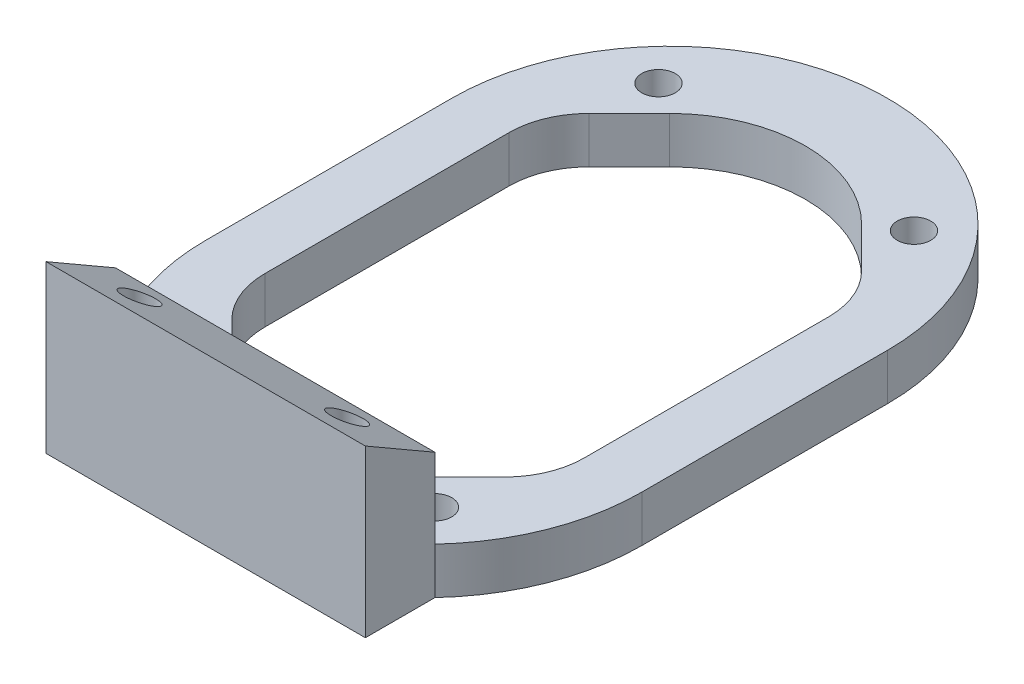
ISO-10303-21;
HEADER;
FILE_DESCRIPTION(('STEP AP214'),'2;1');
FILE_NAME('part.step','',(''),(''),'','','');
FILE_SCHEMA(('AUTOMOTIVE_DESIGN { 1 0 10303 214 1 1 1 1 }'));
ENDSEC;
DATA;
#1=APPLICATION_CONTEXT('core data for automotive mechanical design processes');
#2=APPLICATION_PROTOCOL_DEFINITION('international standard','automotive_design',2000,#1);
#3=PRODUCT_CONTEXT('',#1,'mechanical');
#4=PRODUCT('Part','Part','',(#3));
#5=PRODUCT_RELATED_PRODUCT_CATEGORY('part','',(#4));
#6=PRODUCT_DEFINITION_FORMATION('','',#4);
#7=PRODUCT_DEFINITION_CONTEXT('part definition',#1,'design');
#8=PRODUCT_DEFINITION('design','',#6,#7);
#9=PRODUCT_DEFINITION_SHAPE('','',#8);
#10=(LENGTH_UNIT() NAMED_UNIT(*) SI_UNIT(.MILLI.,.METRE.));
#11=(NAMED_UNIT(*) PLANE_ANGLE_UNIT() SI_UNIT($,.RADIAN.));
#12=(NAMED_UNIT(*) SI_UNIT($,.STERADIAN.) SOLID_ANGLE_UNIT());
#13=UNCERTAINTY_MEASURE_WITH_UNIT(LENGTH_MEASURE(1.E-05),#10,'distance_accuracy_value','');
#14=(GEOMETRIC_REPRESENTATION_CONTEXT(3) GLOBAL_UNCERTAINTY_ASSIGNED_CONTEXT((#13)) GLOBAL_UNIT_ASSIGNED_CONTEXT((#10,
#11,#12)) REPRESENTATION_CONTEXT('',''));
#15=CARTESIAN_POINT('',(0.,0.,0.));
#16=DIRECTION('',(0.,0.,1.));
#17=DIRECTION('',(1.,0.,0.));
#18=AXIS2_PLACEMENT_3D('',#15,#16,#17);
#19=CARTESIAN_POINT('',(0.,2.9,-7.69999999999999));
#20=DIRECTION('',(0.,-1.,0.));
#21=DIRECTION('',(0.,0.,-1.));
#22=AXIS2_PLACEMENT_3D('',#19,#20,#21);
#23=PLANE('',#22);
#24=CARTESIAN_POINT('',(0.,2.9,7.69999999999999));
#25=DIRECTION('',(0.,1.,0.));
#26=DIRECTION('',(0.,0.,1.));
#27=AXIS2_PLACEMENT_3D('',#24,#25,#26);
#28=CIRCLE('',#27,13.6561341528267);
#29=CARTESIAN_POINT('',(-13.6561341528267,2.9,7.69999999999999));
#30=VERTEX_POINT('',#29);
#31=CARTESIAN_POINT('',(-10.,2.9,17.));
#32=VERTEX_POINT('',#31);
#33=EDGE_CURVE('E216',#30,#32,#28,.T.);
#34=ORIENTED_EDGE('',*,*,#33,.T.);
#35=DIRECTION('',(1.,0.,0.));
#36=VECTOR('',#35,1.);
#37=CARTESIAN_POINT('',(0.,2.9,17.));
#38=LINE('',#37,#36);
#39=CARTESIAN_POINT('',(10.,2.9,17.));
#40=VERTEX_POINT('',#39);
#41=EDGE_CURVE('E401',#32,#40,#38,.T.);
#42=ORIENTED_EDGE('',*,*,#41,.T.);
#43=CARTESIAN_POINT('',(13.6561341528267,2.9,7.69999999999999));
#44=VERTEX_POINT('',#43);
#45=EDGE_CURVE('E215',#40,#44,#28,.T.);
#46=ORIENTED_EDGE('',*,*,#45,.T.);
#47=DIRECTION('',(0.,0.,-1.));
#48=VECTOR('',#47,1.);
#49=CARTESIAN_POINT('',(13.6561341528267,2.9,-7.69999999999999));
#50=LINE('',#49,#48);
#51=CARTESIAN_POINT('',(13.6561341528267,2.9,-7.69999999999999));
#52=VERTEX_POINT('',#51);
#53=EDGE_CURVE('E219',#44,#52,#50,.T.);
#54=ORIENTED_EDGE('',*,*,#53,.T.);
#55=CARTESIAN_POINT('',(0.,2.9,-7.69999999999999));
#56=DIRECTION('',(0.,1.,0.));
#57=DIRECTION('',(0.,0.,-1.));
#58=AXIS2_PLACEMENT_3D('',#55,#56,#57);
#59=CIRCLE('',#58,13.6561341528267);
#60=CARTESIAN_POINT('',(-13.6561341528267,2.9,-7.69999999999999));
#61=VERTEX_POINT('',#60);
#62=EDGE_CURVE('E209',#52,#61,#59,.T.);
#63=ORIENTED_EDGE('',*,*,#62,.T.);
#64=DIRECTION('',(0.,0.,1.));
#65=VECTOR('',#64,1.);
#66=CARTESIAN_POINT('',(-13.6561341528267,2.9,7.69999999999999));
#67=LINE('',#66,#65);
#68=EDGE_CURVE('E212',#61,#30,#67,.T.);
#69=ORIENTED_EDGE('',*,*,#68,.T.);
#70=EDGE_LOOP('',(#34,#42,#46,#54,#63,#69));
#71=FACE_BOUND('',#70,.T.);
#72=CARTESIAN_POINT('',(-8.,2.9,-15.));
#73=DIRECTION('',(0.,1.,0.));
#74=DIRECTION('',(0.,0.,1.));
#75=AXIS2_PLACEMENT_3D('',#72,#73,#74);
#76=CIRCLE('',#75,1.05);
#77=CARTESIAN_POINT('',(-8.,2.9,-13.95));
#78=VERTEX_POINT('',#77);
#79=EDGE_CURVE('E203',#78,#78,#76,.T.);
#80=ORIENTED_EDGE('',*,*,#79,.F.);
#81=EDGE_LOOP('',(#80));
#82=FACE_BOUND('',#81,.T.);
#83=CARTESIAN_POINT('',(8.,2.9,-15.));
#84=DIRECTION('',(0.,1.,0.));
#85=DIRECTION('',(0.,0.,1.));
#86=AXIS2_PLACEMENT_3D('',#83,#84,#85);
#87=CIRCLE('',#86,1.05);
#88=CARTESIAN_POINT('',(8.,2.9,-13.95));
#89=VERTEX_POINT('',#88);
#90=EDGE_CURVE('E408',#89,#89,#87,.T.);
#91=ORIENTED_EDGE('',*,*,#90,.F.);
#92=EDGE_LOOP('',(#91));
#93=FACE_BOUND('',#92,.T.);
#94=CARTESIAN_POINT('',(8.,2.9,15.));
#95=DIRECTION('',(0.,1.,0.));
#96=DIRECTION('',(0.,0.,1.));
#97=AXIS2_PLACEMENT_3D('',#94,#95,#96);
#98=CIRCLE('',#97,1.05);
#99=CARTESIAN_POINT('',(8.,2.9,16.05));
#100=VERTEX_POINT('',#99);
#101=EDGE_CURVE('E414',#100,#100,#98,.T.);
#102=ORIENTED_EDGE('',*,*,#101,.F.);
#103=EDGE_LOOP('',(#102));
#104=FACE_BOUND('',#103,.T.);
#105=CARTESIAN_POINT('',(-8.,2.9,15.));
#106=DIRECTION('',(0.,1.,0.));
#107=DIRECTION('',(0.,0.,1.));
#108=AXIS2_PLACEMENT_3D('',#105,#106,#107);
#109=CIRCLE('',#108,1.05);
#110=CARTESIAN_POINT('',(-8.,2.9,16.05));
#111=VERTEX_POINT('',#110);
#112=EDGE_CURVE('E404',#111,#111,#109,.T.);
#113=ORIENTED_EDGE('',*,*,#112,.F.);
#114=EDGE_LOOP('',(#113));
#115=FACE_BOUND('',#114,.T.);
#116=DIRECTION('',(0.707106781186544,0.,0.707106781186551));
#117=VECTOR('',#116,1.);
#118=CARTESIAN_POINT('',(6.01040764008568,2.9,-13.7104076400856));
#119=LINE('',#118,#117);
#120=CARTESIAN_POINT('',(6.01040764008568,2.9,-13.7104076400856));
#121=VERTEX_POINT('',#120);
#122=CARTESIAN_POINT('',(8.53553390593275,2.9,-11.1852813742385));
#123=VERTEX_POINT('',#122);
#124=EDGE_CURVE('E178',#121,#123,#119,.T.);
#125=ORIENTED_EDGE('',*,*,#124,.T.);
#126=CARTESIAN_POINT('',(5.,2.9,-7.6497474683058));
#127=DIRECTION('',(0.,-1.,0.));
#128=DIRECTION('',(0.,0.,-1.));
#129=AXIS2_PLACEMENT_3D('',#126,#127,#128);
#130=CIRCLE('',#129,5.);
#131=CARTESIAN_POINT('',(10.,2.9,-7.64974746830579));
#132=VERTEX_POINT('',#131);
#133=EDGE_CURVE('E40',#123,#132,#130,.T.);
#134=ORIENTED_EDGE('',*,*,#133,.T.);
#135=DIRECTION('',(0.,0.,1.));
#136=VECTOR('',#135,1.);
#137=CARTESIAN_POINT('',(10.,2.9,-9.72081528017126));
#138=LINE('',#137,#136);
#139=CARTESIAN_POINT('',(9.99999999999999,2.9,7.6497474683058));
#140=VERTEX_POINT('',#139);
#141=EDGE_CURVE('E190',#132,#140,#138,.T.);
#142=ORIENTED_EDGE('',*,*,#141,.T.);
#143=CARTESIAN_POINT('',(4.99999999999999,2.9,7.6497474683058));
#144=DIRECTION('',(0.,-1.,0.));
#145=DIRECTION('',(0.,0.,-1.));
#146=AXIS2_PLACEMENT_3D('',#143,#144,#145);
#147=CIRCLE('',#146,5.);
#148=CARTESIAN_POINT('',(8.53553390593275,2.9,11.1852813742385));
#149=VERTEX_POINT('',#148);
#150=EDGE_CURVE('E280',#140,#149,#147,.T.);
#151=ORIENTED_EDGE('',*,*,#150,.T.);
#152=DIRECTION('',(-0.707106781186544,0.,0.707106781186551));
#153=VECTOR('',#152,1.);
#154=CARTESIAN_POINT('',(9.99999999999999,2.9,9.72081528017126));
#155=LINE('',#154,#153);
#156=CARTESIAN_POINT('',(6.01040764008568,2.9,13.7104076400856));
#157=VERTEX_POINT('',#156);
#158=EDGE_CURVE('E290',#149,#157,#155,.T.);
#159=ORIENTED_EDGE('',*,*,#158,.T.);
#160=CARTESIAN_POINT('',(0.,2.9,7.69999999999999));
#161=DIRECTION('',(0.,1.,0.));
#162=DIRECTION('',(0.,0.,1.));
#163=AXIS2_PLACEMENT_3D('',#160,#161,#162);
#164=CIRCLE('',#163,8.5);
#165=CARTESIAN_POINT('',(-6.01040764008568,2.9,13.7104076400856));
#166=VERTEX_POINT('',#165);
#167=EDGE_CURVE('E206',#166,#157,#164,.T.);
#168=ORIENTED_EDGE('',*,*,#167,.F.);
#169=DIRECTION('',(0.707106781186544,0.,0.707106781186551));
#170=VECTOR('',#169,1.);
#171=CARTESIAN_POINT('',(-9.99999999999999,2.9,9.72081528017126));
#172=LINE('',#171,#170);
#173=CARTESIAN_POINT('',(-8.53553390593275,2.9,11.1852813742385));
#174=VERTEX_POINT('',#173);
#175=EDGE_CURVE('E357',#174,#166,#172,.T.);
#176=ORIENTED_EDGE('',*,*,#175,.F.);
#177=CARTESIAN_POINT('',(-4.99999999999999,2.9,7.6497474683058));
#178=DIRECTION('',(0.,-1.,0.));
#179=DIRECTION('',(0.,0.,-1.));
#180=AXIS2_PLACEMENT_3D('',#177,#178,#179);
#181=CIRCLE('',#180,5.);
#182=CARTESIAN_POINT('',(-9.99999999999999,2.9,7.6497474683058));
#183=VERTEX_POINT('',#182);
#184=EDGE_CURVE('E263',#174,#183,#181,.T.);
#185=ORIENTED_EDGE('',*,*,#184,.T.);
#186=DIRECTION('',(0.,0.,1.));
#187=VECTOR('',#186,1.);
#188=CARTESIAN_POINT('',(-10.,2.9,-9.72081528017126));
#189=LINE('',#188,#187);
#190=CARTESIAN_POINT('',(-10.,2.9,-7.64974746830579));
#191=VERTEX_POINT('',#190);
#192=EDGE_CURVE('E363',#191,#183,#189,.T.);
#193=ORIENTED_EDGE('',*,*,#192,.F.);
#194=CARTESIAN_POINT('',(-5.,2.9,-7.6497474683058));
#195=DIRECTION('',(0.,-1.,0.));
#196=DIRECTION('',(0.,0.,-1.));
#197=AXIS2_PLACEMENT_3D('',#194,#195,#196);
#198=CIRCLE('',#197,5.);
#199=CARTESIAN_POINT('',(-8.53553390593275,2.9,-11.1852813742385));
#200=VERTEX_POINT('',#199);
#201=EDGE_CURVE('E267',#191,#200,#198,.T.);
#202=ORIENTED_EDGE('',*,*,#201,.T.);
#203=DIRECTION('',(-0.707106781186544,0.,0.707106781186551));
#204=VECTOR('',#203,1.);
#205=CARTESIAN_POINT('',(-6.01040764008568,2.9,-13.7104076400856));
#206=LINE('',#205,#204);
#207=CARTESIAN_POINT('',(-6.01040764008568,2.9,-13.7104076400856));
#208=VERTEX_POINT('',#207);
#209=EDGE_CURVE('E360',#208,#200,#206,.T.);
#210=ORIENTED_EDGE('',*,*,#209,.F.);
#211=CARTESIAN_POINT('',(0.,2.9,-7.69999999999999));
#212=DIRECTION('',(0.,1.,0.));
#213=DIRECTION('',(0.,0.,-1.));
#214=AXIS2_PLACEMENT_3D('',#211,#212,#213);
#215=CIRCLE('',#214,8.5);
#216=EDGE_CURVE('E200',#121,#208,#215,.T.);
#217=ORIENTED_EDGE('',*,*,#216,.F.);
#218=EDGE_LOOP('',(#125,#134,#142,#151,#159,#168,#176,#185,#193,#202,#210,#217));
#219=FACE_BOUND('',#218,.T.);
#220=ADVANCED_FACE('F32',(#71,#82,#93,#104,#115,#219),#23,.F.);
#221=CARTESIAN_POINT('',(0.,0.,-7.69999999999999));
#222=DIRECTION('',(0.,-1.,0.));
#223=DIRECTION('',(0.,0.,-1.));
#224=AXIS2_PLACEMENT_3D('',#221,#222,#223);
#225=PLANE('',#224);
#226=CARTESIAN_POINT('',(6.5,0.,18.9999999999999));
#227=DIRECTION('',(0.,-1.,0.));
#228=DIRECTION('',(0.,0.,-1.));
#229=AXIS2_PLACEMENT_3D('',#226,#227,#228);
#230=CIRCLE('',#229,1.);
#231=CARTESIAN_POINT('',(6.5,0.,17.9999999999999));
#232=VERTEX_POINT('',#231);
#233=EDGE_CURVE('E250',#232,#232,#230,.T.);
#234=ORIENTED_EDGE('',*,*,#233,.F.);
#235=EDGE_LOOP('',(#234));
#236=FACE_BOUND('',#235,.T.);
#237=CARTESIAN_POINT('',(-6.5,0.,18.9999999999999));
#238=DIRECTION('',(0.,-1.,0.));
#239=DIRECTION('',(0.,0.,-1.));
#240=AXIS2_PLACEMENT_3D('',#237,#238,#239);
#241=CIRCLE('',#240,1.);
#242=CARTESIAN_POINT('',(-6.5,0.,17.9999999999999));
#243=VERTEX_POINT('',#242);
#244=EDGE_CURVE('E367',#243,#243,#241,.T.);
#245=ORIENTED_EDGE('',*,*,#244,.F.);
#246=EDGE_LOOP('',(#245));
#247=FACE_BOUND('',#246,.T.);
#248=CARTESIAN_POINT('',(0.,0.,7.69999999999999));
#249=DIRECTION('',(0.,1.,0.));
#250=DIRECTION('',(0.,0.,1.));
#251=AXIS2_PLACEMENT_3D('',#248,#249,#250);
#252=CIRCLE('',#251,13.6561341528267);
#253=CARTESIAN_POINT('',(10.,0.,17.));
#254=VERTEX_POINT('',#253);
#255=CARTESIAN_POINT('',(13.6561341528267,0.,7.69999999999999));
#256=VERTEX_POINT('',#255);
#257=EDGE_CURVE('E227',#254,#256,#252,.T.);
#258=ORIENTED_EDGE('',*,*,#257,.F.);
#259=DIRECTION('',(0.,0.,-1.));
#260=VECTOR('',#259,1.);
#261=CARTESIAN_POINT('',(10.,0.,17.));
#262=LINE('',#261,#260);
#263=CARTESIAN_POINT('',(10.,0.,21.3561341528267));
#264=VERTEX_POINT('',#263);
#265=EDGE_CURVE('E388',#264,#254,#262,.T.);
#266=ORIENTED_EDGE('',*,*,#265,.F.);
#267=DIRECTION('',(1.,0.,0.));
#268=VECTOR('',#267,1.);
#269=CARTESIAN_POINT('',(10.,0.,21.3561341528267));
#270=LINE('',#269,#268);
#271=CARTESIAN_POINT('',(-9.99999999999999,0.,21.3561341528267));
#272=VERTEX_POINT('',#271);
#273=EDGE_CURVE('E379',#272,#264,#270,.T.);
#274=ORIENTED_EDGE('',*,*,#273,.F.);
#275=DIRECTION('',(0.,0.,1.));
#276=VECTOR('',#275,1.);
#277=CARTESIAN_POINT('',(-10.,0.,17.));
#278=LINE('',#277,#276);
#279=CARTESIAN_POINT('',(-10.,0.,17.));
#280=VERTEX_POINT('',#279);
#281=EDGE_CURVE('E383',#280,#272,#278,.T.);
#282=ORIENTED_EDGE('',*,*,#281,.F.);
#283=CARTESIAN_POINT('',(-13.6561341528267,0.,7.69999999999999));
#284=VERTEX_POINT('',#283);
#285=EDGE_CURVE('E228',#284,#280,#252,.T.);
#286=ORIENTED_EDGE('',*,*,#285,.F.);
#287=DIRECTION('',(0.,0.,1.));
#288=VECTOR('',#287,1.);
#289=CARTESIAN_POINT('',(-13.6561341528267,0.,7.69999999999999));
#290=LINE('',#289,#288);
#291=CARTESIAN_POINT('',(-13.6561341528267,0.,-7.69999999999999));
#292=VERTEX_POINT('',#291);
#293=EDGE_CURVE('E225',#292,#284,#290,.T.);
#294=ORIENTED_EDGE('',*,*,#293,.F.);
#295=CARTESIAN_POINT('',(0.,0.,-7.69999999999999));
#296=DIRECTION('',(0.,1.,0.));
#297=DIRECTION('',(0.,0.,-1.));
#298=AXIS2_PLACEMENT_3D('',#295,#296,#297);
#299=CIRCLE('',#298,13.6561341528267);
#300=CARTESIAN_POINT('',(13.6561341528267,0.,-7.69999999999999));
#301=VERTEX_POINT('',#300);
#302=EDGE_CURVE('E222',#301,#292,#299,.T.);
#303=ORIENTED_EDGE('',*,*,#302,.F.);
#304=DIRECTION('',(0.,0.,-1.));
#305=VECTOR('',#304,1.);
#306=CARTESIAN_POINT('',(13.6561341528267,0.,-7.69999999999999));
#307=LINE('',#306,#305);
#308=EDGE_CURVE('E213',#256,#301,#307,.T.);
#309=ORIENTED_EDGE('',*,*,#308,.F.);
#310=EDGE_LOOP('',(#258,#266,#274,#282,#286,#294,#303,#309));
#311=FACE_BOUND('',#310,.T.);
#312=CARTESIAN_POINT('',(-8.,0.,15.));
#313=DIRECTION('',(0.,1.,0.));
#314=DIRECTION('',(0.,0.,1.));
#315=AXIS2_PLACEMENT_3D('',#312,#313,#314);
#316=CIRCLE('',#315,1.05);
#317=CARTESIAN_POINT('',(-8.,0.,16.05));
#318=VERTEX_POINT('',#317);
#319=EDGE_CURVE('E417',#318,#318,#316,.T.);
#320=ORIENTED_EDGE('',*,*,#319,.T.);
#321=EDGE_LOOP('',(#320));
#322=FACE_BOUND('',#321,.T.);
#323=CARTESIAN_POINT('',(8.,0.,15.));
#324=DIRECTION('',(0.,1.,0.));
#325=DIRECTION('',(0.,0.,1.));
#326=AXIS2_PLACEMENT_3D('',#323,#324,#325);
#327=CIRCLE('',#326,1.05);
#328=CARTESIAN_POINT('',(8.,0.,16.05));
#329=VERTEX_POINT('',#328);
#330=EDGE_CURVE('E411',#329,#329,#327,.T.);
#331=ORIENTED_EDGE('',*,*,#330,.T.);
#332=EDGE_LOOP('',(#331));
#333=FACE_BOUND('',#332,.T.);
#334=CARTESIAN_POINT('',(8.,0.,-15.));
#335=DIRECTION('',(0.,1.,0.));
#336=DIRECTION('',(0.,0.,1.));
#337=AXIS2_PLACEMENT_3D('',#334,#335,#336);
#338=CIRCLE('',#337,1.05);
#339=CARTESIAN_POINT('',(8.,0.,-13.95));
#340=VERTEX_POINT('',#339);
#341=EDGE_CURVE('E405',#340,#340,#338,.T.);
#342=ORIENTED_EDGE('',*,*,#341,.T.);
#343=EDGE_LOOP('',(#342));
#344=FACE_BOUND('',#343,.T.);
#345=CARTESIAN_POINT('',(-8.,0.,-15.));
#346=DIRECTION('',(0.,1.,0.));
#347=DIRECTION('',(0.,0.,1.));
#348=AXIS2_PLACEMENT_3D('',#345,#346,#347);
#349=CIRCLE('',#348,1.05);
#350=CARTESIAN_POINT('',(-8.,0.,-13.95));
#351=VERTEX_POINT('',#350);
#352=EDGE_CURVE('E197',#351,#351,#349,.T.);
#353=ORIENTED_EDGE('',*,*,#352,.T.);
#354=EDGE_LOOP('',(#353));
#355=FACE_BOUND('',#354,.T.);
#356=DIRECTION('',(0.,0.,1.));
#357=VECTOR('',#356,1.);
#358=CARTESIAN_POINT('',(10.,0.,-9.72081528017126));
#359=LINE('',#358,#357);
#360=CARTESIAN_POINT('',(10.,0.,-7.64974746830579));
#361=VERTEX_POINT('',#360);
#362=CARTESIAN_POINT('',(9.99999999999999,0.,7.6497474683058));
#363=VERTEX_POINT('',#362);
#364=EDGE_CURVE('E183',#361,#363,#359,.T.);
#365=ORIENTED_EDGE('',*,*,#364,.F.);
#366=CARTESIAN_POINT('',(5.,0.,-7.6497474683058));
#367=DIRECTION('',(0.,-1.,0.));
#368=DIRECTION('',(0.,0.,-1.));
#369=AXIS2_PLACEMENT_3D('',#366,#367,#368);
#370=CIRCLE('',#369,5.);
#371=CARTESIAN_POINT('',(8.53553390593275,0.,-11.1852813742385));
#372=VERTEX_POINT('',#371);
#373=EDGE_CURVE('E11',#361,#372,#370,.F.);
#374=ORIENTED_EDGE('',*,*,#373,.T.);
#375=DIRECTION('',(0.707106781186544,0.,0.707106781186551));
#376=VECTOR('',#375,1.);
#377=CARTESIAN_POINT('',(6.01040764008568,0.,-13.7104076400856));
#378=LINE('',#377,#376);
#379=CARTESIAN_POINT('',(6.01040764008568,0.,-13.7104076400856));
#380=VERTEX_POINT('',#379);
#381=EDGE_CURVE('E176',#380,#372,#378,.T.);
#382=ORIENTED_EDGE('',*,*,#381,.F.);
#383=CARTESIAN_POINT('',(0.,0.,-7.69999999999999));
#384=DIRECTION('',(0.,1.,0.));
#385=DIRECTION('',(0.,0.,-1.));
#386=AXIS2_PLACEMENT_3D('',#383,#384,#385);
#387=CIRCLE('',#386,8.5);
#388=CARTESIAN_POINT('',(-6.01040764008568,0.,-13.7104076400856));
#389=VERTEX_POINT('',#388);
#390=EDGE_CURVE('E187',#380,#389,#387,.T.);
#391=ORIENTED_EDGE('',*,*,#390,.T.);
#392=DIRECTION('',(-0.707106781186544,0.,0.707106781186551));
#393=VECTOR('',#392,1.);
#394=CARTESIAN_POINT('',(-6.01040764008568,0.,-13.7104076400856));
#395=LINE('',#394,#393);
#396=CARTESIAN_POINT('',(-8.53553390593275,0.,-11.1852813742385));
#397=VERTEX_POINT('',#396);
#398=EDGE_CURVE('E348',#389,#397,#395,.T.);
#399=ORIENTED_EDGE('',*,*,#398,.T.);
#400=CARTESIAN_POINT('',(-5.,0.,-7.6497474683058));
#401=DIRECTION('',(0.,-1.,0.));
#402=DIRECTION('',(0.,0.,-1.));
#403=AXIS2_PLACEMENT_3D('',#400,#401,#402);
#404=CIRCLE('',#403,5.);
#405=CARTESIAN_POINT('',(-10.,0.,-7.64974746830579));
#406=VERTEX_POINT('',#405);
#407=EDGE_CURVE('E269',#397,#406,#404,.F.);
#408=ORIENTED_EDGE('',*,*,#407,.T.);
#409=DIRECTION('',(0.,0.,1.));
#410=VECTOR('',#409,1.);
#411=CARTESIAN_POINT('',(-10.,0.,-9.72081528017126));
#412=LINE('',#411,#410);
#413=CARTESIAN_POINT('',(-9.99999999999999,0.,7.6497474683058));
#414=VERTEX_POINT('',#413);
#415=EDGE_CURVE('E346',#406,#414,#412,.T.);
#416=ORIENTED_EDGE('',*,*,#415,.T.);
#417=CARTESIAN_POINT('',(-4.99999999999999,0.,7.6497474683058));
#418=DIRECTION('',(0.,-1.,0.));
#419=DIRECTION('',(0.,0.,-1.));
#420=AXIS2_PLACEMENT_3D('',#417,#418,#419);
#421=CIRCLE('',#420,5.);
#422=CARTESIAN_POINT('',(-8.53553390593275,0.,11.1852813742385));
#423=VERTEX_POINT('',#422);
#424=EDGE_CURVE('E265',#414,#423,#421,.F.);
#425=ORIENTED_EDGE('',*,*,#424,.T.);
#426=DIRECTION('',(0.707106781186544,0.,0.707106781186551));
#427=VECTOR('',#426,1.);
#428=CARTESIAN_POINT('',(-9.99999999999999,0.,9.72081528017126));
#429=LINE('',#428,#427);
#430=CARTESIAN_POINT('',(-6.01040764008568,0.,13.7104076400856));
#431=VERTEX_POINT('',#430);
#432=EDGE_CURVE('E353',#423,#431,#429,.T.);
#433=ORIENTED_EDGE('',*,*,#432,.T.);
#434=CARTESIAN_POINT('',(0.,0.,7.69999999999999));
#435=DIRECTION('',(0.,1.,0.));
#436=DIRECTION('',(0.,0.,1.));
#437=AXIS2_PLACEMENT_3D('',#434,#435,#436);
#438=CIRCLE('',#437,8.5);
#439=CARTESIAN_POINT('',(6.01040764008568,0.,13.7104076400856));
#440=VERTEX_POINT('',#439);
#441=EDGE_CURVE('E196',#431,#440,#438,.T.);
#442=ORIENTED_EDGE('',*,*,#441,.T.);
#443=DIRECTION('',(-0.707106781186544,0.,0.707106781186551));
#444=VECTOR('',#443,1.);
#445=CARTESIAN_POINT('',(9.99999999999999,0.,9.72081528017126));
#446=LINE('',#445,#444);
#447=CARTESIAN_POINT('',(8.53553390593275,0.,11.1852813742385));
#448=VERTEX_POINT('',#447);
#449=EDGE_CURVE('E189',#448,#440,#446,.T.);
#450=ORIENTED_EDGE('',*,*,#449,.F.);
#451=CARTESIAN_POINT('',(4.99999999999999,0.,7.6497474683058));
#452=DIRECTION('',(0.,-1.,0.));
#453=DIRECTION('',(0.,0.,-1.));
#454=AXIS2_PLACEMENT_3D('',#451,#452,#453);
#455=CIRCLE('',#454,5.);
#456=EDGE_CURVE('E282',#448,#363,#455,.F.);
#457=ORIENTED_EDGE('',*,*,#456,.T.);
#458=EDGE_LOOP('',(#365,#374,#382,#391,#399,#408,#416,#425,#433,#442,#450,#457));
#459=FACE_BOUND('',#458,.T.);
#460=ADVANCED_FACE('F185',(#236,#247,#311,#322,#333,#344,#355,#459),#225,.T.);
#461=CARTESIAN_POINT('',(0.,2.9,-7.69999999999999));
#462=DIRECTION('',(0.,-1.,0.));
#463=DIRECTION('',(0.,0.,-1.));
#464=AXIS2_PLACEMENT_3D('',#461,#462,#463);
#465=CYLINDRICAL_SURFACE('',#464,8.5);
#466=ORIENTED_EDGE('',*,*,#390,.F.);
#467=DIRECTION('',(0.,1.,0.));
#468=VECTOR('',#467,1.);
#469=CARTESIAN_POINT('',(6.01040764008568,0.,-13.7104076400856));
#470=LINE('',#469,#468);
#471=EDGE_CURVE('E174',#380,#121,#470,.T.);
#472=ORIENTED_EDGE('',*,*,#471,.T.);
#473=ORIENTED_EDGE('',*,*,#216,.T.);
#474=DIRECTION('',(0.,1.,0.));
#475=VECTOR('',#474,1.);
#476=CARTESIAN_POINT('',(-6.01040764008568,0.,-13.7104076400856));
#477=LINE('',#476,#475);
#478=EDGE_CURVE('E195',#389,#208,#477,.T.);
#479=ORIENTED_EDGE('',*,*,#478,.F.);
#480=EDGE_LOOP('',(#466,#472,#473,#479));
#481=FACE_BOUND('',#480,.T.);
#482=ADVANCED_FACE('F193',(#481),#465,.F.);
#483=CARTESIAN_POINT('',(0.,2.9,7.69999999999999));
#484=DIRECTION('',(0.,-1.,0.));
#485=DIRECTION('',(0.,0.,-1.));
#486=AXIS2_PLACEMENT_3D('',#483,#484,#485);
#487=CYLINDRICAL_SURFACE('',#486,8.5);
#488=ORIENTED_EDGE('',*,*,#167,.T.);
#489=DIRECTION('',(0.,1.,0.));
#490=VECTOR('',#489,1.);
#491=CARTESIAN_POINT('',(6.01040764008568,0.,13.7104076400856));
#492=LINE('',#491,#490);
#493=EDGE_CURVE('E182',#440,#157,#492,.T.);
#494=ORIENTED_EDGE('',*,*,#493,.F.);
#495=ORIENTED_EDGE('',*,*,#441,.F.);
#496=DIRECTION('',(0.,1.,0.));
#497=VECTOR('',#496,1.);
#498=CARTESIAN_POINT('',(-6.01040764008568,0.,13.7104076400856));
#499=LINE('',#498,#497);
#500=EDGE_CURVE('E355',#431,#166,#499,.T.);
#501=ORIENTED_EDGE('',*,*,#500,.T.);
#502=EDGE_LOOP('',(#488,#494,#495,#501));
#503=FACE_BOUND('',#502,.T.);
#504=ADVANCED_FACE('F427',(#503),#487,.F.);
#505=CARTESIAN_POINT('',(0.,2.9,7.69999999999999));
#506=DIRECTION('',(0.,-1.,0.));
#507=DIRECTION('',(0.,0.,-1.));
#508=AXIS2_PLACEMENT_3D('',#505,#506,#507);
#509=CYLINDRICAL_SURFACE('',#508,13.6561341528267);
#510=ORIENTED_EDGE('',*,*,#45,.F.);
#511=DIRECTION('',(0.,1.,0.));
#512=VECTOR('',#511,1.);
#513=CARTESIAN_POINT('',(10.,-20.4689009171822,17.));
#514=LINE('',#513,#512);
#515=EDGE_CURVE('E394',#254,#40,#514,.T.);
#516=ORIENTED_EDGE('',*,*,#515,.F.);
#517=ORIENTED_EDGE('',*,*,#257,.T.);
#518=DIRECTION('',(0.,-1.,0.));
#519=VECTOR('',#518,1.);
#520=CARTESIAN_POINT('',(13.6561341528267,2.9,7.69999999999999));
#521=LINE('',#520,#519);
#522=EDGE_CURVE('E234',#44,#256,#521,.T.);
#523=ORIENTED_EDGE('',*,*,#522,.F.);
#524=EDGE_LOOP('',(#510,#516,#517,#523));
#525=FACE_BOUND('',#524,.T.);
#526=ADVANCED_FACE('F321',(#525),#509,.T.);
#527=CARTESIAN_POINT('',(0.,2.9,-7.69999999999999));
#528=DIRECTION('',(0.,-1.,0.));
#529=DIRECTION('',(0.,0.,-1.));
#530=AXIS2_PLACEMENT_3D('',#527,#528,#529);
#531=CYLINDRICAL_SURFACE('',#530,13.6561341528267);
#532=ORIENTED_EDGE('',*,*,#302,.T.);
#533=DIRECTION('',(0.,-1.,0.));
#534=VECTOR('',#533,1.);
#535=CARTESIAN_POINT('',(-13.6561341528267,2.9,-7.69999999999999));
#536=LINE('',#535,#534);
#537=EDGE_CURVE('E240',#61,#292,#536,.T.);
#538=ORIENTED_EDGE('',*,*,#537,.F.);
#539=ORIENTED_EDGE('',*,*,#62,.F.);
#540=DIRECTION('',(0.,-1.,0.));
#541=VECTOR('',#540,1.);
#542=CARTESIAN_POINT('',(13.6561341528267,2.9,-7.69999999999999));
#543=LINE('',#542,#541);
#544=EDGE_CURVE('E221',#52,#301,#543,.T.);
#545=ORIENTED_EDGE('',*,*,#544,.T.);
#546=EDGE_LOOP('',(#532,#538,#539,#545));
#547=FACE_BOUND('',#546,.T.);
#548=ADVANCED_FACE('F324',(#547),#531,.T.);
#549=CARTESIAN_POINT('',(-13.6561341528267,2.9,7.69999999999999));
#550=DIRECTION('',(1.,0.,0.));
#551=DIRECTION('',(0.,0.,-1.));
#552=AXIS2_PLACEMENT_3D('',#549,#550,#551);
#553=PLANE('',#552);
#554=ORIENTED_EDGE('',*,*,#293,.T.);
#555=DIRECTION('',(0.,-1.,0.));
#556=VECTOR('',#555,1.);
#557=CARTESIAN_POINT('',(-13.6561341528267,2.9,7.69999999999999));
#558=LINE('',#557,#556);
#559=EDGE_CURVE('E237',#30,#284,#558,.T.);
#560=ORIENTED_EDGE('',*,*,#559,.F.);
#561=ORIENTED_EDGE('',*,*,#68,.F.);
#562=ORIENTED_EDGE('',*,*,#537,.T.);
#563=EDGE_LOOP('',(#554,#560,#561,#562));
#564=FACE_BOUND('',#563,.T.);
#565=ADVANCED_FACE('F319',(#564),#553,.F.);
#566=ORIENTED_EDGE('',*,*,#285,.T.);
#567=DIRECTION('',(0.,1.,0.));
#568=VECTOR('',#567,1.);
#569=CARTESIAN_POINT('',(-10.,-20.4689009171822,17.));
#570=LINE('',#569,#568);
#571=EDGE_CURVE('E387',#280,#32,#570,.T.);
#572=ORIENTED_EDGE('',*,*,#571,.T.);
#573=ORIENTED_EDGE('',*,*,#33,.F.);
#574=ORIENTED_EDGE('',*,*,#559,.T.);
#575=EDGE_LOOP('',(#566,#572,#573,#574));
#576=FACE_BOUND('',#575,.T.);
#577=ADVANCED_FACE('F315',(#576),#509,.T.);
#578=CARTESIAN_POINT('',(13.6561341528267,2.9,-7.69999999999999));
#579=DIRECTION('',(-1.,0.,0.));
#580=DIRECTION('',(0.,0.,1.));
#581=AXIS2_PLACEMENT_3D('',#578,#579,#580);
#582=PLANE('',#581);
#583=ORIENTED_EDGE('',*,*,#308,.T.);
#584=ORIENTED_EDGE('',*,*,#544,.F.);
#585=ORIENTED_EDGE('',*,*,#53,.F.);
#586=ORIENTED_EDGE('',*,*,#522,.T.);
#587=EDGE_LOOP('',(#583,#584,#585,#586));
#588=FACE_BOUND('',#587,.T.);
#589=ADVANCED_FACE('F311',(#588),#582,.F.);
#590=CARTESIAN_POINT('',(-8.,0.,-15.));
#591=DIRECTION('',(0.,1.,0.));
#592=DIRECTION('',(0.,0.,1.));
#593=AXIS2_PLACEMENT_3D('',#590,#591,#592);
#594=CYLINDRICAL_SURFACE('',#593,1.05);
#595=ORIENTED_EDGE('',*,*,#352,.F.);
#596=EDGE_LOOP('',(#595));
#597=FACE_BOUND('',#596,.T.);
#598=ORIENTED_EDGE('',*,*,#79,.T.);
#599=EDGE_LOOP('',(#598));
#600=FACE_BOUND('',#599,.T.);
#601=ADVANCED_FACE('F314',(#597,#600),#594,.F.);
#602=CARTESIAN_POINT('',(8.,0.,-15.));
#603=DIRECTION('',(0.,1.,0.));
#604=DIRECTION('',(0.,0.,1.));
#605=AXIS2_PLACEMENT_3D('',#602,#603,#604);
#606=CYLINDRICAL_SURFACE('',#605,1.05);
#607=ORIENTED_EDGE('',*,*,#341,.F.);
#608=EDGE_LOOP('',(#607));
#609=FACE_BOUND('',#608,.T.);
#610=ORIENTED_EDGE('',*,*,#90,.T.);
#611=EDGE_LOOP('',(#610));
#612=FACE_BOUND('',#611,.T.);
#613=ADVANCED_FACE('F486',(#609,#612),#606,.F.);
#614=CARTESIAN_POINT('',(8.,0.,15.));
#615=DIRECTION('',(0.,1.,0.));
#616=DIRECTION('',(0.,0.,1.));
#617=AXIS2_PLACEMENT_3D('',#614,#615,#616);
#618=CYLINDRICAL_SURFACE('',#617,1.05);
#619=ORIENTED_EDGE('',*,*,#330,.F.);
#620=EDGE_LOOP('',(#619));
#621=FACE_BOUND('',#620,.T.);
#622=ORIENTED_EDGE('',*,*,#101,.T.);
#623=EDGE_LOOP('',(#622));
#624=FACE_BOUND('',#623,.T.);
#625=ADVANCED_FACE('F489',(#621,#624),#618,.F.);
#626=CARTESIAN_POINT('',(-8.,0.,15.));
#627=DIRECTION('',(0.,1.,0.));
#628=DIRECTION('',(0.,0.,1.));
#629=AXIS2_PLACEMENT_3D('',#626,#627,#628);
#630=CYLINDRICAL_SURFACE('',#629,1.05);
#631=ORIENTED_EDGE('',*,*,#319,.F.);
#632=EDGE_LOOP('',(#631));
#633=FACE_BOUND('',#632,.T.);
#634=ORIENTED_EDGE('',*,*,#112,.T.);
#635=EDGE_LOOP('',(#634));
#636=FACE_BOUND('',#635,.T.);
#637=ADVANCED_FACE('F478',(#633,#636),#630,.F.);
#638=CARTESIAN_POINT('',(-10.,-20.4689009171822,17.));
#639=DIRECTION('',(0.,0.,-1.));
#640=DIRECTION('',(-1.,0.,0.));
#641=AXIS2_PLACEMENT_3D('',#638,#639,#640);
#642=PLANE('',#641);
#643=DIRECTION('',(1.,0.,0.));
#644=VECTOR('',#643,1.);
#645=CARTESIAN_POINT('',(-13.6561341528268,7.88498477423936,17.));
#646=LINE('',#645,#644);
#647=CARTESIAN_POINT('',(-10.,7.88498477423938,17.));
#648=VERTEX_POINT('',#647);
#649=CARTESIAN_POINT('',(10.,7.88498477423936,17.));
#650=VERTEX_POINT('',#649);
#651=EDGE_CURVE('E376',#648,#650,#646,.T.);
#652=ORIENTED_EDGE('',*,*,#651,.T.);
#653=EDGE_CURVE('E390',#40,#650,#514,.T.);
#654=ORIENTED_EDGE('',*,*,#653,.F.);
#655=ORIENTED_EDGE('',*,*,#41,.F.);
#656=EDGE_CURVE('E393',#32,#648,#570,.T.);
#657=ORIENTED_EDGE('',*,*,#656,.T.);
#658=EDGE_LOOP('',(#652,#654,#655,#657));
#659=FACE_BOUND('',#658,.T.);
#660=ADVANCED_FACE('F474',(#659),#642,.T.);
#661=CARTESIAN_POINT('',(10.,-20.4689009171822,21.3561341528267));
#662=DIRECTION('',(0.,0.,1.));
#663=DIRECTION('',(1.,0.,0.));
#664=AXIS2_PLACEMENT_3D('',#661,#662,#663);
#665=PLANE('',#664);
#666=DIRECTION('',(1.,0.,0.));
#667=VECTOR('',#666,1.);
#668=CARTESIAN_POINT('',(-13.6561341528268,10.4,21.3561341528267));
#669=LINE('',#668,#667);
#670=CARTESIAN_POINT('',(-10.,10.4,21.3561341528267));
#671=VERTEX_POINT('',#670);
#672=CARTESIAN_POINT('',(10.,10.4,21.3561341528267));
#673=VERTEX_POINT('',#672);
#674=EDGE_CURVE('E375',#671,#673,#669,.T.);
#675=ORIENTED_EDGE('',*,*,#674,.F.);
#676=DIRECTION('',(0.,1.,0.));
#677=VECTOR('',#676,1.);
#678=CARTESIAN_POINT('',(-10.,-20.4689009171822,21.3561341528267));
#679=LINE('',#678,#677);
#680=EDGE_CURVE('E386',#272,#671,#679,.T.);
#681=ORIENTED_EDGE('',*,*,#680,.F.);
#682=ORIENTED_EDGE('',*,*,#273,.T.);
#683=DIRECTION('',(0.,1.,0.));
#684=VECTOR('',#683,1.);
#685=CARTESIAN_POINT('',(10.,-20.4689009171822,21.3561341528267));
#686=LINE('',#685,#684);
#687=EDGE_CURVE('E382',#264,#673,#686,.T.);
#688=ORIENTED_EDGE('',*,*,#687,.T.);
#689=EDGE_LOOP('',(#675,#681,#682,#688));
#690=FACE_BOUND('',#689,.T.);
#691=ADVANCED_FACE('F477',(#690),#665,.T.);
#692=CARTESIAN_POINT('',(10.,-20.4689009171822,17.));
#693=DIRECTION('',(1.,0.,0.));
#694=DIRECTION('',(0.,0.,-1.));
#695=AXIS2_PLACEMENT_3D('',#692,#693,#694);
#696=PLANE('',#695);
#697=DIRECTION('',(0.,-0.500000000000004,-0.866025403784436));
#698=VECTOR('',#697,1.);
#699=CARTESIAN_POINT('',(10.,10.4,21.3561341528267));
#700=LINE('',#699,#698);
#701=EDGE_CURVE('E253',#673,#650,#700,.T.);
#702=ORIENTED_EDGE('',*,*,#701,.F.);
#703=ORIENTED_EDGE('',*,*,#687,.F.);
#704=ORIENTED_EDGE('',*,*,#265,.T.);
#705=ORIENTED_EDGE('',*,*,#515,.T.);
#706=ORIENTED_EDGE('',*,*,#653,.T.);
#707=EDGE_LOOP('',(#702,#703,#704,#705,#706));
#708=FACE_BOUND('',#707,.T.);
#709=ADVANCED_FACE('F472',(#708),#696,.T.);
#710=CARTESIAN_POINT('',(-10.,-20.4689009171822,17.));
#711=DIRECTION('',(-1.,0.,0.));
#712=DIRECTION('',(0.,0.,1.));
#713=AXIS2_PLACEMENT_3D('',#710,#711,#712);
#714=PLANE('',#713);
#715=DIRECTION('',(0.,0.500000000000004,0.866025403784436));
#716=VECTOR('',#715,1.);
#717=CARTESIAN_POINT('',(-10.,0.796513351383869,4.72240734761434));
#718=LINE('',#717,#716);
#719=EDGE_CURVE('E243',#648,#671,#718,.T.);
#720=ORIENTED_EDGE('',*,*,#719,.F.);
#721=ORIENTED_EDGE('',*,*,#656,.F.);
#722=ORIENTED_EDGE('',*,*,#571,.F.);
#723=ORIENTED_EDGE('',*,*,#281,.T.);
#724=ORIENTED_EDGE('',*,*,#680,.T.);
#725=EDGE_LOOP('',(#720,#721,#722,#723,#724));
#726=FACE_BOUND('',#725,.T.);
#727=ADVANCED_FACE('F468',(#726),#714,.T.);
#728=CARTESIAN_POINT('',(-13.6561341528268,10.4,21.3561341528267));
#729=DIRECTION('',(0.,-0.866025403784436,0.500000000000004));
#730=DIRECTION('',(0.,-0.500000000000004,-0.866025403784436));
#731=AXIS2_PLACEMENT_3D('',#728,#729,#730);
#732=PLANE('',#731);
#733=CARTESIAN_POINT('',(6.5,9.03968531261856,18.9999999999999));
#734=DIRECTION('',(0.,-0.866025403784436,0.500000000000004));
#735=DIRECTION('',(0.,-0.500000000000004,-0.866025403784436));
#736=AXIS2_PLACEMENT_3D('',#733,#734,#735);
#737=ELLIPSE('',#736,1.15470053837926,1.);
#738=CARTESIAN_POINT('',(6.5,8.46233504342893,17.9999999999999));
#739=VERTEX_POINT('',#738);
#740=EDGE_CURVE('E249',#739,#739,#737,.T.);
#741=ORIENTED_EDGE('',*,*,#740,.T.);
#742=EDGE_LOOP('',(#741));
#743=FACE_BOUND('',#742,.T.);
#744=CARTESIAN_POINT('',(-6.5,9.03968531261858,18.9999999999999));
#745=DIRECTION('',(0.,-0.866025403784436,0.500000000000004));
#746=DIRECTION('',(0.,-0.500000000000004,-0.866025403784436));
#747=AXIS2_PLACEMENT_3D('',#744,#745,#746);
#748=ELLIPSE('',#747,1.15470053837926,1.);
#749=CARTESIAN_POINT('',(-6.5,8.46233504342894,17.9999999999999));
#750=VERTEX_POINT('',#749);
#751=EDGE_CURVE('E246',#750,#750,#748,.T.);
#752=ORIENTED_EDGE('',*,*,#751,.T.);
#753=EDGE_LOOP('',(#752));
#754=FACE_BOUND('',#753,.T.);
#755=ORIENTED_EDGE('',*,*,#719,.T.);
#756=ORIENTED_EDGE('',*,*,#674,.T.);
#757=ORIENTED_EDGE('',*,*,#701,.T.);
#758=ORIENTED_EDGE('',*,*,#651,.F.);
#759=EDGE_LOOP('',(#755,#756,#757,#758));
#760=FACE_BOUND('',#759,.T.);
#761=ADVANCED_FACE('F464',(#743,#754,#760),#732,.F.);
#762=CARTESIAN_POINT('',(-6.5,10.4,18.9999999999999));
#763=DIRECTION('',(0.,-1.,0.));
#764=DIRECTION('',(0.,0.,-1.));
#765=AXIS2_PLACEMENT_3D('',#762,#763,#764);
#766=CYLINDRICAL_SURFACE('',#765,1.);
#767=ORIENTED_EDGE('',*,*,#244,.T.);
#768=EDGE_LOOP('',(#767));
#769=FACE_BOUND('',#768,.T.);
#770=ORIENTED_EDGE('',*,*,#751,.F.);
#771=EDGE_LOOP('',(#770));
#772=FACE_BOUND('',#771,.T.);
#773=ADVANCED_FACE('F457',(#769,#772),#766,.F.);
#774=CARTESIAN_POINT('',(6.5,10.4,18.9999999999999));
#775=DIRECTION('',(0.,-1.,0.));
#776=DIRECTION('',(0.,0.,-1.));
#777=AXIS2_PLACEMENT_3D('',#774,#775,#776);
#778=CYLINDRICAL_SURFACE('',#777,1.);
#779=ORIENTED_EDGE('',*,*,#233,.T.);
#780=EDGE_LOOP('',(#779));
#781=FACE_BOUND('',#780,.T.);
#782=ORIENTED_EDGE('',*,*,#740,.F.);
#783=EDGE_LOOP('',(#782));
#784=FACE_BOUND('',#783,.T.);
#785=ADVANCED_FACE('F450',(#781,#784),#778,.F.);
#786=CARTESIAN_POINT('',(-6.01040764008568,0.,-13.7104076400856));
#787=DIRECTION('',(-0.707106781186551,0.,-0.707106781186544));
#788=DIRECTION('',(-0.707106781186544,0.,0.707106781186551));
#789=AXIS2_PLACEMENT_3D('',#786,#787,#788);
#790=PLANE('',#789);
#791=ORIENTED_EDGE('',*,*,#209,.T.);
#792=DIRECTION('',(0.,1.,0.));
#793=VECTOR('',#792,1.);
#794=CARTESIAN_POINT('',(-8.53553390593275,0.,-11.1852813742385));
#795=LINE('',#794,#793);
#796=EDGE_CURVE('E261',#200,#397,#795,.F.);
#797=ORIENTED_EDGE('',*,*,#796,.T.);
#798=ORIENTED_EDGE('',*,*,#398,.F.);
#799=ORIENTED_EDGE('',*,*,#478,.T.);
#800=EDGE_LOOP('',(#791,#797,#798,#799));
#801=FACE_BOUND('',#800,.T.);
#802=ADVANCED_FACE('F448',(#801),#790,.F.);
#803=CARTESIAN_POINT('',(-9.99999999999999,0.,9.72081528017126));
#804=DIRECTION('',(-0.707106781186551,0.,0.707106781186544));
#805=DIRECTION('',(0.707106781186544,0.,0.707106781186551));
#806=AXIS2_PLACEMENT_3D('',#803,#804,#805);
#807=PLANE('',#806);
#808=ORIENTED_EDGE('',*,*,#432,.F.);
#809=DIRECTION('',(0.,1.,0.));
#810=VECTOR('',#809,1.);
#811=CARTESIAN_POINT('',(-8.53553390593275,2.9,11.1852813742385));
#812=LINE('',#811,#810);
#813=EDGE_CURVE('E245',#423,#174,#812,.T.);
#814=ORIENTED_EDGE('',*,*,#813,.T.);
#815=ORIENTED_EDGE('',*,*,#175,.T.);
#816=ORIENTED_EDGE('',*,*,#500,.F.);
#817=EDGE_LOOP('',(#808,#814,#815,#816));
#818=FACE_BOUND('',#817,.T.);
#819=ADVANCED_FACE('F445',(#818),#807,.F.);
#820=CARTESIAN_POINT('',(-10.,0.,-9.72081528017126));
#821=DIRECTION('',(-1.,0.,0.));
#822=DIRECTION('',(0.,0.,1.));
#823=AXIS2_PLACEMENT_3D('',#820,#821,#822);
#824=PLANE('',#823);
#825=ORIENTED_EDGE('',*,*,#192,.T.);
#826=DIRECTION('',(0.,1.,0.));
#827=VECTOR('',#826,1.);
#828=CARTESIAN_POINT('',(-9.99999999999999,0.,7.6497474683058));
#829=LINE('',#828,#827);
#830=EDGE_CURVE('E259',#183,#414,#829,.F.);
#831=ORIENTED_EDGE('',*,*,#830,.T.);
#832=ORIENTED_EDGE('',*,*,#415,.F.);
#833=DIRECTION('',(0.,1.,0.));
#834=VECTOR('',#833,1.);
#835=CARTESIAN_POINT('',(-10.,2.9,-7.64974746830579));
#836=LINE('',#835,#834);
#837=EDGE_CURVE('E256',#406,#191,#836,.T.);
#838=ORIENTED_EDGE('',*,*,#837,.T.);
#839=EDGE_LOOP('',(#825,#831,#832,#838));
#840=FACE_BOUND('',#839,.T.);
#841=ADVANCED_FACE('F333',(#840),#824,.F.);
#842=CARTESIAN_POINT('',(-4.99999999999999,0.,7.6497474683058));
#843=DIRECTION('',(0.,-1.,0.));
#844=DIRECTION('',(0.,0.,-1.));
#845=AXIS2_PLACEMENT_3D('',#842,#843,#844);
#846=CYLINDRICAL_SURFACE('',#845,5.);
#847=ORIENTED_EDGE('',*,*,#424,.F.);
#848=ORIENTED_EDGE('',*,*,#830,.F.);
#849=ORIENTED_EDGE('',*,*,#184,.F.);
#850=ORIENTED_EDGE('',*,*,#813,.F.);
#851=EDGE_LOOP('',(#847,#848,#849,#850));
#852=FACE_BOUND('',#851,.T.);
#853=ADVANCED_FACE('F329',(#852),#846,.F.);
#854=CARTESIAN_POINT('',(-5.,0.,-7.6497474683058));
#855=DIRECTION('',(0.,-1.,0.));
#856=DIRECTION('',(0.,0.,-1.));
#857=AXIS2_PLACEMENT_3D('',#854,#855,#856);
#858=CYLINDRICAL_SURFACE('',#857,5.);
#859=ORIENTED_EDGE('',*,*,#407,.F.);
#860=ORIENTED_EDGE('',*,*,#796,.F.);
#861=ORIENTED_EDGE('',*,*,#201,.F.);
#862=ORIENTED_EDGE('',*,*,#837,.F.);
#863=EDGE_LOOP('',(#859,#860,#861,#862));
#864=FACE_BOUND('',#863,.T.);
#865=ADVANCED_FACE('F332',(#864),#858,.F.);
#866=CARTESIAN_POINT('',(6.01040764008568,0.,-13.7104076400856));
#867=DIRECTION('',(-0.707106781186551,0.,0.707106781186544));
#868=DIRECTION('',(0.707106781186544,0.,0.707106781186551));
#869=AXIS2_PLACEMENT_3D('',#866,#867,#868);
#870=PLANE('',#869);
#871=ORIENTED_EDGE('',*,*,#381,.T.);
#872=DIRECTION('',(0.,1.,0.));
#873=VECTOR('',#872,1.);
#874=CARTESIAN_POINT('',(8.53553390593275,2.9,-11.1852813742385));
#875=LINE('',#874,#873);
#876=EDGE_CURVE('E278',#372,#123,#875,.T.);
#877=ORIENTED_EDGE('',*,*,#876,.T.);
#878=ORIENTED_EDGE('',*,*,#124,.F.);
#879=ORIENTED_EDGE('',*,*,#471,.F.);
#880=EDGE_LOOP('',(#871,#877,#878,#879));
#881=FACE_BOUND('',#880,.T.);
#882=ADVANCED_FACE('F175',(#881),#870,.T.);
#883=CARTESIAN_POINT('',(10.,0.,-9.72081528017126));
#884=DIRECTION('',(-1.,0.,0.));
#885=DIRECTION('',(0.,0.,1.));
#886=AXIS2_PLACEMENT_3D('',#883,#884,#885);
#887=PLANE('',#886);
#888=ORIENTED_EDGE('',*,*,#364,.T.);
#889=DIRECTION('',(0.,1.,0.));
#890=VECTOR('',#889,1.);
#891=CARTESIAN_POINT('',(9.99999999999999,2.9,7.6497474683058));
#892=LINE('',#891,#890);
#893=EDGE_CURVE('E273',#363,#140,#892,.T.);
#894=ORIENTED_EDGE('',*,*,#893,.T.);
#895=ORIENTED_EDGE('',*,*,#141,.F.);
#896=DIRECTION('',(0.,1.,0.));
#897=VECTOR('',#896,1.);
#898=CARTESIAN_POINT('',(10.,0.,-7.64974746830579));
#899=LINE('',#898,#897);
#900=EDGE_CURVE('E271',#132,#361,#899,.F.);
#901=ORIENTED_EDGE('',*,*,#900,.T.);
#902=EDGE_LOOP('',(#888,#894,#895,#901));
#903=FACE_BOUND('',#902,.T.);
#904=ADVANCED_FACE('F288',(#903),#887,.T.);
#905=CARTESIAN_POINT('',(9.99999999999999,0.,9.72081528017126));
#906=DIRECTION('',(-0.707106781186551,0.,-0.707106781186544));
#907=DIRECTION('',(-0.707106781186544,0.,0.707106781186551));
#908=AXIS2_PLACEMENT_3D('',#905,#906,#907);
#909=PLANE('',#908);
#910=ORIENTED_EDGE('',*,*,#158,.F.);
#911=DIRECTION('',(0.,1.,0.));
#912=VECTOR('',#911,1.);
#913=CARTESIAN_POINT('',(8.53553390593275,0.,11.1852813742385));
#914=LINE('',#913,#912);
#915=EDGE_CURVE('E276',#149,#448,#914,.F.);
#916=ORIENTED_EDGE('',*,*,#915,.T.);
#917=ORIENTED_EDGE('',*,*,#449,.T.);
#918=ORIENTED_EDGE('',*,*,#493,.T.);
#919=EDGE_LOOP('',(#910,#916,#917,#918));
#920=FACE_BOUND('',#919,.T.);
#921=ADVANCED_FACE('F297',(#920),#909,.T.);
#922=CARTESIAN_POINT('',(4.99999999999999,0.,7.6497474683058));
#923=DIRECTION('',(0.,-1.,0.));
#924=DIRECTION('',(0.,0.,-1.));
#925=AXIS2_PLACEMENT_3D('',#922,#923,#924);
#926=CYLINDRICAL_SURFACE('',#925,5.);
#927=ORIENTED_EDGE('',*,*,#456,.F.);
#928=ORIENTED_EDGE('',*,*,#915,.F.);
#929=ORIENTED_EDGE('',*,*,#150,.F.);
#930=ORIENTED_EDGE('',*,*,#893,.F.);
#931=EDGE_LOOP('',(#927,#928,#929,#930));
#932=FACE_BOUND('',#931,.T.);
#933=ADVANCED_FACE('F293',(#932),#926,.F.);
#934=CARTESIAN_POINT('',(5.,0.,-7.6497474683058));
#935=DIRECTION('',(0.,-1.,0.));
#936=DIRECTION('',(0.,0.,-1.));
#937=AXIS2_PLACEMENT_3D('',#934,#935,#936);
#938=CYLINDRICAL_SURFACE('',#937,5.);
#939=ORIENTED_EDGE('',*,*,#373,.F.);
#940=ORIENTED_EDGE('',*,*,#900,.F.);
#941=ORIENTED_EDGE('',*,*,#133,.F.);
#942=ORIENTED_EDGE('',*,*,#876,.F.);
#943=EDGE_LOOP('',(#939,#940,#941,#942));
#944=FACE_BOUND('',#943,.T.);
#945=ADVANCED_FACE('F34',(#944),#938,.F.);
#946=CLOSED_SHELL('',(#220,#460,#482,#504,#526,#548,#565,#577,#589,#601,#613,#625,#637,#660,
#691,#709,#727,#761,#773,#785,#802,#819,#841,#853,#865,#882,#904,#921,#933,#945));
#947=MANIFOLD_SOLID_BREP('B2',#946);
#948=ADVANCED_BREP_SHAPE_REPRESENTATION('',(#18,#947),#14);
#949=SHAPE_DEFINITION_REPRESENTATION(#9,#948);
ENDSEC;
END-ISO-10303-21;
